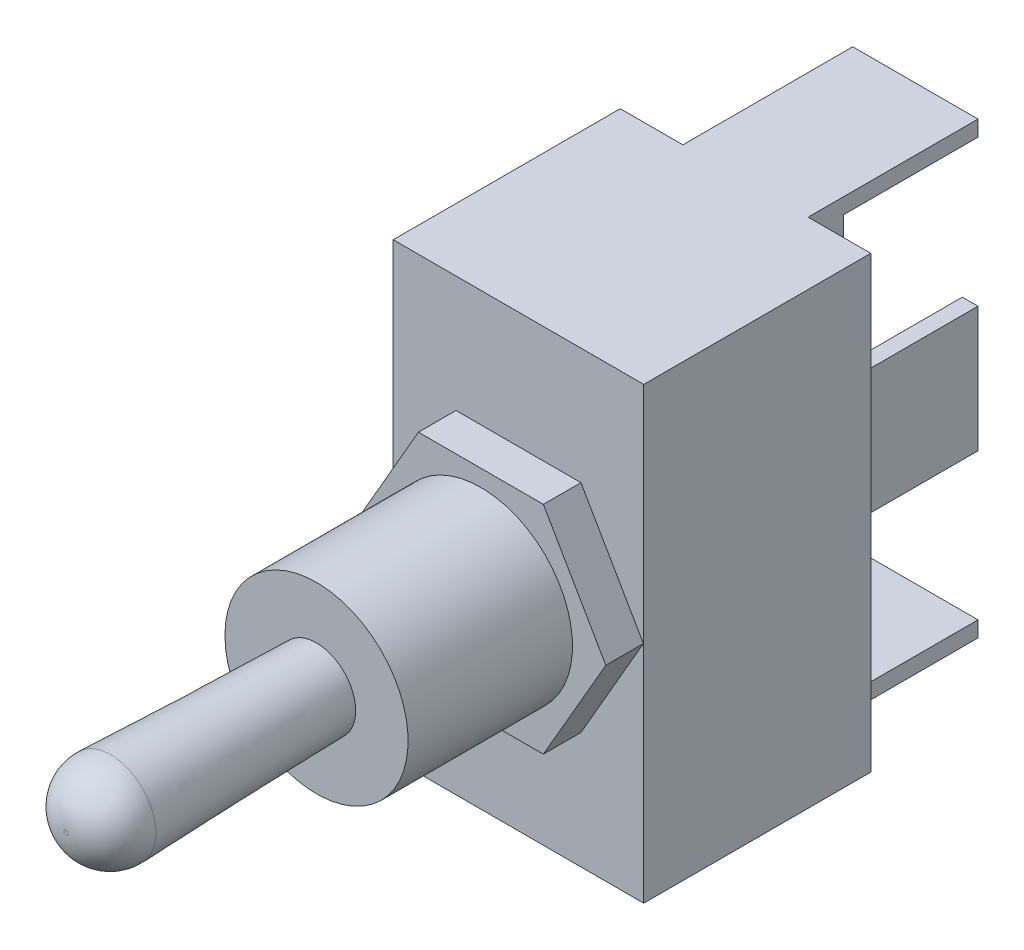
ISO-10303-21;
HEADER;
FILE_DESCRIPTION(('STEP AP214'),'2;1');
FILE_NAME('part.step','',(''),(''),'','','');
FILE_SCHEMA(('AUTOMOTIVE_DESIGN { 1 0 10303 214 1 1 1 1 }'));
ENDSEC;
DATA;
#1=APPLICATION_CONTEXT('core data for automotive mechanical design processes');
#2=APPLICATION_PROTOCOL_DEFINITION('international standard','automotive_design',2000,#1);
#3=PRODUCT_CONTEXT('',#1,'mechanical');
#4=PRODUCT('Part','Part','',(#3));
#5=PRODUCT_RELATED_PRODUCT_CATEGORY('part','',(#4));
#6=PRODUCT_DEFINITION_FORMATION('','',#4);
#7=PRODUCT_DEFINITION_CONTEXT('part definition',#1,'design');
#8=PRODUCT_DEFINITION('design','',#6,#7);
#9=PRODUCT_DEFINITION_SHAPE('','',#8);
#10=(LENGTH_UNIT() NAMED_UNIT(*) SI_UNIT(.MILLI.,.METRE.));
#11=(NAMED_UNIT(*) PLANE_ANGLE_UNIT() SI_UNIT($,.RADIAN.));
#12=(NAMED_UNIT(*) SI_UNIT($,.STERADIAN.) SOLID_ANGLE_UNIT());
#13=UNCERTAINTY_MEASURE_WITH_UNIT(LENGTH_MEASURE(1.E-05),#10,'distance_accuracy_value','');
#14=(GEOMETRIC_REPRESENTATION_CONTEXT(3) GLOBAL_UNCERTAINTY_ASSIGNED_CONTEXT((#13)) GLOBAL_UNIT_ASSIGNED_CONTEXT((#10,
#11,#12)) REPRESENTATION_CONTEXT('',''));
#15=CARTESIAN_POINT('',(0.,0.,0.));
#16=DIRECTION('',(0.,0.,1.));
#17=DIRECTION('',(1.,0.,0.));
#18=AXIS2_PLACEMENT_3D('',#15,#16,#17);
#19=CARTESIAN_POINT('',(0.,0.,-2.25));
#20=DIRECTION('',(0.,0.,1.));
#21=DIRECTION('',(1.,0.,0.));
#22=AXIS2_PLACEMENT_3D('',#19,#20,#21);
#23=PLANE('',#22);
#24=DIRECTION('',(-1.,0.,0.));
#25=VECTOR('',#24,1.);
#26=CARTESIAN_POINT('',(4.,-4.,-2.25));
#27=LINE('',#26,#25);
#28=CARTESIAN_POINT('',(4.,-4.,-2.25));
#29=VERTEX_POINT('',#28);
#30=CARTESIAN_POINT('',(3.,-4.,-2.25));
#31=VERTEX_POINT('',#30);
#32=EDGE_CURVE('E492',#29,#31,#27,.T.);
#33=ORIENTED_EDGE('',*,*,#32,.F.);
#34=DIRECTION('',(0.,-1.,0.));
#35=VECTOR('',#34,1.);
#36=CARTESIAN_POINT('',(4.,-14.35,-2.25));
#37=LINE('',#36,#35);
#38=CARTESIAN_POINT('',(4.,-13.35,-2.25));
#39=VERTEX_POINT('',#38);
#40=EDGE_CURVE('E215',#29,#39,#37,.T.);
#41=ORIENTED_EDGE('',*,*,#40,.T.);
#42=DIRECTION('',(1.,0.,0.));
#43=VECTOR('',#42,1.);
#44=CARTESIAN_POINT('',(4.,-13.35,-2.25));
#45=LINE('',#44,#43);
#46=CARTESIAN_POINT('',(-4.,-13.35,-2.25));
#47=VERTEX_POINT('',#46);
#48=EDGE_CURVE('E216',#47,#39,#45,.T.);
#49=ORIENTED_EDGE('',*,*,#48,.F.);
#50=DIRECTION('',(0.,1.,0.));
#51=VECTOR('',#50,1.);
#52=CARTESIAN_POINT('',(-4.,-14.35,-2.25));
#53=LINE('',#52,#51);
#54=CARTESIAN_POINT('',(-4.,13.35,-2.25));
#55=VERTEX_POINT('',#54);
#56=EDGE_CURVE('E263',#47,#55,#53,.T.);
#57=ORIENTED_EDGE('',*,*,#56,.T.);
#58=DIRECTION('',(-1.,0.,0.));
#59=VECTOR('',#58,1.);
#60=CARTESIAN_POINT('',(4.,13.35,-2.25));
#61=LINE('',#60,#59);
#62=CARTESIAN_POINT('',(4.,13.35,-2.25));
#63=VERTEX_POINT('',#62);
#64=EDGE_CURVE('E239',#63,#55,#61,.T.);
#65=ORIENTED_EDGE('',*,*,#64,.F.);
#66=CARTESIAN_POINT('',(4.,4.,-2.25));
#67=VERTEX_POINT('',#66);
#68=EDGE_CURVE('E266',#63,#67,#37,.T.);
#69=ORIENTED_EDGE('',*,*,#68,.T.);
#70=DIRECTION('',(1.,0.,0.));
#71=VECTOR('',#70,1.);
#72=CARTESIAN_POINT('',(4.,4.,-2.25));
#73=LINE('',#72,#71);
#74=CARTESIAN_POINT('',(3.,4.,-2.25));
#75=VERTEX_POINT('',#74);
#76=EDGE_CURVE('E64',#75,#67,#73,.T.);
#77=ORIENTED_EDGE('',*,*,#76,.F.);
#78=DIRECTION('',(0.,1.,0.));
#79=VECTOR('',#78,1.);
#80=CARTESIAN_POINT('',(3.,4.,-2.25));
#81=LINE('',#80,#79);
#82=EDGE_CURVE('E59',#31,#75,#81,.T.);
#83=ORIENTED_EDGE('',*,*,#82,.F.);
#84=EDGE_LOOP('',(#33,#41,#49,#57,#65,#69,#77,#83));
#85=FACE_BOUND('',#84,.T.);
#86=ADVANCED_FACE('F44',(#85),#23,.F.);
#87=CARTESIAN_POINT('',(0.,0.,27.4));
#88=DIRECTION('',(0.,0.,1.));
#89=DIRECTION('',(1.,0.,0.));
#90=AXIS2_PLACEMENT_3D('',#87,#88,#89);
#91=PLANE('',#90);
#92=CARTESIAN_POINT('',(0.,0.,27.4));
#93=DIRECTION('',(0.,0.,1.));
#94=DIRECTION('',(1.,0.,0.));
#95=AXIS2_PLACEMENT_3D('',#92,#93,#94);
#96=CIRCLE('',#95,5.85);
#97=CARTESIAN_POINT('',(-5.85,0.,27.4));
#98=VERTEX_POINT('',#97);
#99=EDGE_CURVE('E283',#98,#98,#96,.T.);
#100=ORIENTED_EDGE('',*,*,#99,.T.);
#101=EDGE_LOOP('',(#100));
#102=FACE_BOUND('',#101,.T.);
#103=CARTESIAN_POINT('',(0.,0.,27.4));
#104=DIRECTION('',(0.,0.,1.));
#105=DIRECTION('',(1.,0.,0.));
#106=AXIS2_PLACEMENT_3D('',#103,#104,#105);
#107=CIRCLE('',#106,2.5);
#108=CARTESIAN_POINT('',(2.46798003498705,0.398841505996216,27.4));
#109=VERTEX_POINT('',#108);
#110=EDGE_CURVE('E259',#109,#109,#107,.T.);
#111=ORIENTED_EDGE('',*,*,#110,.F.);
#112=EDGE_LOOP('',(#111));
#113=FACE_BOUND('',#112,.T.);
#114=ADVANCED_FACE('F391',(#102,#113),#91,.T.);
#115=CARTESIAN_POINT('',(0.,0.,0.));
#116=DIRECTION('',(0.,0.,-1.));
#117=DIRECTION('',(-1.,0.,0.));
#118=AXIS2_PLACEMENT_3D('',#115,#116,#117);
#119=PLANE('',#118);
#120=DIRECTION('',(0.,1.,0.));
#121=VECTOR('',#120,1.);
#122=CARTESIAN_POINT('',(-4.,-14.35,0.));
#123=LINE('',#122,#121);
#124=CARTESIAN_POINT('',(-4.,-14.35,0.));
#125=VERTEX_POINT('',#124);
#126=CARTESIAN_POINT('',(-4.,14.35,0.));
#127=VERTEX_POINT('',#126);
#128=EDGE_CURVE('E262',#125,#127,#123,.T.);
#129=ORIENTED_EDGE('',*,*,#128,.F.);
#130=DIRECTION('',(1.,0.,0.));
#131=VECTOR('',#130,1.);
#132=CARTESIAN_POINT('',(-8.,-14.35,0.));
#133=LINE('',#132,#131);
#134=CARTESIAN_POINT('',(-8.,-14.35,0.));
#135=VERTEX_POINT('',#134);
#136=EDGE_CURVE('E344',#135,#125,#133,.T.);
#137=ORIENTED_EDGE('',*,*,#136,.F.);
#138=DIRECTION('',(0.,-1.,0.));
#139=VECTOR('',#138,1.);
#140=CARTESIAN_POINT('',(-8.,-14.35,0.));
#141=LINE('',#140,#139);
#142=CARTESIAN_POINT('',(-8.,14.35,0.));
#143=VERTEX_POINT('',#142);
#144=EDGE_CURVE('E357',#143,#135,#141,.T.);
#145=ORIENTED_EDGE('',*,*,#144,.F.);
#146=DIRECTION('',(-1.,0.,0.));
#147=VECTOR('',#146,1.);
#148=CARTESIAN_POINT('',(-8.,14.35,0.));
#149=LINE('',#148,#147);
#150=EDGE_CURVE('E353',#127,#143,#149,.T.);
#151=ORIENTED_EDGE('',*,*,#150,.F.);
#152=EDGE_LOOP('',(#129,#137,#145,#151));
#153=FACE_BOUND('',#152,.T.);
#154=ADVANCED_FACE('F396',(#153),#119,.T.);
#155=CARTESIAN_POINT('',(0.,0.,14.5));
#156=DIRECTION('',(0.,0.,-1.));
#157=DIRECTION('',(-1.,0.,0.));
#158=AXIS2_PLACEMENT_3D('',#155,#156,#157);
#159=PLANE('',#158);
#160=DIRECTION('',(0.,1.,0.));
#161=VECTOR('',#160,1.);
#162=CARTESIAN_POINT('',(8.,-14.35,14.5));
#163=LINE('',#162,#161);
#164=CARTESIAN_POINT('',(8.,-14.35,14.5));
#165=VERTEX_POINT('',#164);
#166=CARTESIAN_POINT('',(8.,14.35,14.5));
#167=VERTEX_POINT('',#166);
#168=EDGE_CURVE('E340',#165,#167,#163,.T.);
#169=ORIENTED_EDGE('',*,*,#168,.T.);
#170=DIRECTION('',(-1.,0.,0.));
#171=VECTOR('',#170,1.);
#172=CARTESIAN_POINT('',(-8.,14.35,14.5));
#173=LINE('',#172,#171);
#174=CARTESIAN_POINT('',(-8.,14.35,14.5));
#175=VERTEX_POINT('',#174);
#176=EDGE_CURVE('E343',#167,#175,#173,.T.);
#177=ORIENTED_EDGE('',*,*,#176,.T.);
#178=DIRECTION('',(0.,-1.,0.));
#179=VECTOR('',#178,1.);
#180=CARTESIAN_POINT('',(-8.,-14.35,14.5));
#181=LINE('',#180,#179);
#182=CARTESIAN_POINT('',(-8.,-14.35,14.5));
#183=VERTEX_POINT('',#182);
#184=EDGE_CURVE('E346',#175,#183,#181,.T.);
#185=ORIENTED_EDGE('',*,*,#184,.T.);
#186=DIRECTION('',(1.,0.,0.));
#187=VECTOR('',#186,1.);
#188=CARTESIAN_POINT('',(-8.,-14.35,14.5));
#189=LINE('',#188,#187);
#190=EDGE_CURVE('E348',#183,#165,#189,.T.);
#191=ORIENTED_EDGE('',*,*,#190,.T.);
#192=EDGE_LOOP('',(#169,#177,#185,#191));
#193=FACE_BOUND('',#192,.T.);
#194=DIRECTION('',(-0.5,-0.866025403784439,0.));
#195=VECTOR('',#194,1.);
#196=CARTESIAN_POINT('',(-3.98949036010031,6.91,14.5));
#197=LINE('',#196,#195);
#198=CARTESIAN_POINT('',(-3.98949036010031,6.91,14.5));
#199=VERTEX_POINT('',#198);
#200=CARTESIAN_POINT('',(-7.97898072020063,0.,14.5));
#201=VERTEX_POINT('',#200);
#202=EDGE_CURVE('E286',#199,#201,#197,.T.);
#203=ORIENTED_EDGE('',*,*,#202,.F.);
#204=DIRECTION('',(-1.,0.,0.));
#205=VECTOR('',#204,1.);
#206=CARTESIAN_POINT('',(3.98949036010032,6.91,14.5));
#207=LINE('',#206,#205);
#208=CARTESIAN_POINT('',(3.98949036010032,6.91,14.5));
#209=VERTEX_POINT('',#208);
#210=EDGE_CURVE('E295',#209,#199,#207,.T.);
#211=ORIENTED_EDGE('',*,*,#210,.F.);
#212=DIRECTION('',(-0.5,0.866025403784439,0.));
#213=VECTOR('',#212,1.);
#214=CARTESIAN_POINT('',(7.97898072020063,0.,14.5));
#215=LINE('',#214,#213);
#216=CARTESIAN_POINT('',(7.97898072020063,0.,14.5));
#217=VERTEX_POINT('',#216);
#218=EDGE_CURVE('E317',#217,#209,#215,.T.);
#219=ORIENTED_EDGE('',*,*,#218,.F.);
#220=DIRECTION('',(0.5,0.866025403784439,0.));
#221=VECTOR('',#220,1.);
#222=CARTESIAN_POINT('',(3.98949036010031,-6.91,14.5));
#223=LINE('',#222,#221);
#224=CARTESIAN_POINT('',(3.98949036010031,-6.91,14.5));
#225=VERTEX_POINT('',#224);
#226=EDGE_CURVE('E314',#225,#217,#223,.T.);
#227=ORIENTED_EDGE('',*,*,#226,.F.);
#228=DIRECTION('',(1.,0.,0.));
#229=VECTOR('',#228,1.);
#230=CARTESIAN_POINT('',(-3.98949036010032,-6.91,14.5));
#231=LINE('',#230,#229);
#232=CARTESIAN_POINT('',(-3.98949036010032,-6.91,14.5));
#233=VERTEX_POINT('',#232);
#234=EDGE_CURVE('E311',#233,#225,#231,.T.);
#235=ORIENTED_EDGE('',*,*,#234,.F.);
#236=DIRECTION('',(0.5,-0.866025403784439,0.));
#237=VECTOR('',#236,1.);
#238=CARTESIAN_POINT('',(-7.97898072020063,0.,14.5));
#239=LINE('',#238,#237);
#240=EDGE_CURVE('E308',#201,#233,#239,.T.);
#241=ORIENTED_EDGE('',*,*,#240,.F.);
#242=EDGE_LOOP('',(#203,#211,#219,#227,#235,#241));
#243=FACE_BOUND('',#242,.T.);
#244=ADVANCED_FACE('F440',(#193,#243),#159,.F.);
#245=CARTESIAN_POINT('',(8.,-14.35,14.5));
#246=DIRECTION('',(-1.,0.,0.));
#247=DIRECTION('',(0.,0.,1.));
#248=AXIS2_PLACEMENT_3D('',#245,#246,#247);
#249=PLANE('',#248);
#250=DIRECTION('',(0.,1.,0.));
#251=VECTOR('',#250,1.);
#252=CARTESIAN_POINT('',(8.,-14.35,0.));
#253=LINE('',#252,#251);
#254=CARTESIAN_POINT('',(8.,-14.35,0.));
#255=VERTEX_POINT('',#254);
#256=CARTESIAN_POINT('',(8.,14.35,0.));
#257=VERTEX_POINT('',#256);
#258=EDGE_CURVE('E339',#255,#257,#253,.T.);
#259=ORIENTED_EDGE('',*,*,#258,.T.);
#260=DIRECTION('',(0.,0.,-1.));
#261=VECTOR('',#260,1.);
#262=CARTESIAN_POINT('',(8.,14.35,14.5));
#263=LINE('',#262,#261);
#264=EDGE_CURVE('E290',#167,#257,#263,.T.);
#265=ORIENTED_EDGE('',*,*,#264,.F.);
#266=ORIENTED_EDGE('',*,*,#168,.F.);
#267=DIRECTION('',(0.,0.,-1.));
#268=VECTOR('',#267,1.);
#269=CARTESIAN_POINT('',(8.,-14.35,14.5));
#270=LINE('',#269,#268);
#271=EDGE_CURVE('E350',#165,#255,#270,.T.);
#272=ORIENTED_EDGE('',*,*,#271,.T.);
#273=EDGE_LOOP('',(#259,#265,#266,#272));
#274=FACE_BOUND('',#273,.T.);
#275=ADVANCED_FACE('F443',(#274),#249,.F.);
#276=CARTESIAN_POINT('',(-8.,14.35,14.5));
#277=DIRECTION('',(0.,-1.,0.));
#278=DIRECTION('',(0.,0.,-1.));
#279=AXIS2_PLACEMENT_3D('',#276,#277,#278);
#280=PLANE('',#279);
#281=CARTESIAN_POINT('',(4.,14.35,0.));
#282=VERTEX_POINT('',#281);
#283=EDGE_CURVE('E354',#257,#282,#149,.T.);
#284=ORIENTED_EDGE('',*,*,#283,.T.);
#285=DIRECTION('',(0.,0.,1.));
#286=VECTOR('',#285,1.);
#287=CARTESIAN_POINT('',(4.,14.35,-2.25));
#288=LINE('',#287,#286);
#289=CARTESIAN_POINT('',(4.,14.35,-10.85));
#290=VERTEX_POINT('',#289);
#291=EDGE_CURVE('E277',#290,#282,#288,.T.);
#292=ORIENTED_EDGE('',*,*,#291,.F.);
#293=DIRECTION('',(1.,0.,0.));
#294=VECTOR('',#293,1.);
#295=CARTESIAN_POINT('',(4.,14.35,-10.85));
#296=LINE('',#295,#294);
#297=CARTESIAN_POINT('',(-4.,14.35,-10.85));
#298=VERTEX_POINT('',#297);
#299=EDGE_CURVE('E248',#298,#290,#296,.T.);
#300=ORIENTED_EDGE('',*,*,#299,.F.);
#301=DIRECTION('',(0.,0.,1.));
#302=VECTOR('',#301,1.);
#303=CARTESIAN_POINT('',(-4.,14.35,-2.25));
#304=LINE('',#303,#302);
#305=EDGE_CURVE('E280',#298,#127,#304,.T.);
#306=ORIENTED_EDGE('',*,*,#305,.T.);
#307=ORIENTED_EDGE('',*,*,#150,.T.);
#308=DIRECTION('',(0.,0.,-1.));
#309=VECTOR('',#308,1.);
#310=CARTESIAN_POINT('',(-8.,14.35,14.5));
#311=LINE('',#310,#309);
#312=EDGE_CURVE('E367',#175,#143,#311,.T.);
#313=ORIENTED_EDGE('',*,*,#312,.F.);
#314=ORIENTED_EDGE('',*,*,#176,.F.);
#315=ORIENTED_EDGE('',*,*,#264,.T.);
#316=EDGE_LOOP('',(#284,#292,#300,#306,#307,#313,#314,#315));
#317=FACE_BOUND('',#316,.T.);
#318=ADVANCED_FACE('F455',(#317),#280,.F.);
#319=CARTESIAN_POINT('',(-8.,-14.35,14.5));
#320=DIRECTION('',(1.,0.,0.));
#321=DIRECTION('',(0.,0.,-1.));
#322=AXIS2_PLACEMENT_3D('',#319,#320,#321);
#323=PLANE('',#322);
#324=ORIENTED_EDGE('',*,*,#144,.T.);
#325=DIRECTION('',(0.,0.,-1.));
#326=VECTOR('',#325,1.);
#327=CARTESIAN_POINT('',(-8.,-14.35,14.5));
#328=LINE('',#327,#326);
#329=EDGE_CURVE('E364',#183,#135,#328,.T.);
#330=ORIENTED_EDGE('',*,*,#329,.F.);
#331=ORIENTED_EDGE('',*,*,#184,.F.);
#332=ORIENTED_EDGE('',*,*,#312,.T.);
#333=EDGE_LOOP('',(#324,#330,#331,#332));
#334=FACE_BOUND('',#333,.T.);
#335=ADVANCED_FACE('F451',(#334),#323,.F.);
#336=CARTESIAN_POINT('',(-8.,-14.35,14.5));
#337=DIRECTION('',(0.,1.,0.));
#338=DIRECTION('',(0.,0.,1.));
#339=AXIS2_PLACEMENT_3D('',#336,#337,#338);
#340=PLANE('',#339);
#341=ORIENTED_EDGE('',*,*,#136,.T.);
#342=DIRECTION('',(0.,0.,1.));
#343=VECTOR('',#342,1.);
#344=CARTESIAN_POINT('',(-4.,-14.35,-2.25));
#345=LINE('',#344,#343);
#346=CARTESIAN_POINT('',(-4.,-14.35,-10.85));
#347=VERTEX_POINT('',#346);
#348=EDGE_CURVE('E268',#347,#125,#345,.T.);
#349=ORIENTED_EDGE('',*,*,#348,.F.);
#350=DIRECTION('',(-1.,0.,0.));
#351=VECTOR('',#350,1.);
#352=CARTESIAN_POINT('',(4.,-14.35,-10.85));
#353=LINE('',#352,#351);
#354=CARTESIAN_POINT('',(4.,-14.35,-10.85));
#355=VERTEX_POINT('',#354);
#356=EDGE_CURVE('E227',#355,#347,#353,.T.);
#357=ORIENTED_EDGE('',*,*,#356,.F.);
#358=DIRECTION('',(0.,0.,1.));
#359=VECTOR('',#358,1.);
#360=CARTESIAN_POINT('',(4.,-14.35,-2.25));
#361=LINE('',#360,#359);
#362=CARTESIAN_POINT('',(4.,-14.35,0.));
#363=VERTEX_POINT('',#362);
#364=EDGE_CURVE('E274',#355,#363,#361,.T.);
#365=ORIENTED_EDGE('',*,*,#364,.T.);
#366=EDGE_CURVE('E359',#363,#255,#133,.T.);
#367=ORIENTED_EDGE('',*,*,#366,.T.);
#368=ORIENTED_EDGE('',*,*,#271,.F.);
#369=ORIENTED_EDGE('',*,*,#190,.F.);
#370=ORIENTED_EDGE('',*,*,#329,.T.);
#371=EDGE_LOOP('',(#341,#349,#357,#365,#367,#368,#369,#370));
#372=FACE_BOUND('',#371,.T.);
#373=ADVANCED_FACE('F447',(#372),#340,.F.);
#374=DIRECTION('',(0.,-1.,0.));
#375=VECTOR('',#374,1.);
#376=CARTESIAN_POINT('',(4.,-14.35,0.));
#377=LINE('',#376,#375);
#378=EDGE_CURVE('E265',#282,#363,#377,.T.);
#379=ORIENTED_EDGE('',*,*,#378,.F.);
#380=ORIENTED_EDGE('',*,*,#283,.F.);
#381=ORIENTED_EDGE('',*,*,#258,.F.);
#382=ORIENTED_EDGE('',*,*,#366,.F.);
#383=EDGE_LOOP('',(#379,#380,#381,#382));
#384=FACE_BOUND('',#383,.T.);
#385=ADVANCED_FACE('F438',(#384),#119,.T.);
#386=CARTESIAN_POINT('',(-3.98949036010031,6.91,16.9));
#387=DIRECTION('',(0.866025403784439,-0.5,0.));
#388=DIRECTION('',(0.5,0.866025403784439,0.));
#389=AXIS2_PLACEMENT_3D('',#386,#387,#388);
#390=PLANE('',#389);
#391=ORIENTED_EDGE('',*,*,#202,.T.);
#392=DIRECTION('',(0.,0.,-1.));
#393=VECTOR('',#392,1.);
#394=CARTESIAN_POINT('',(-7.97898072020063,0.,16.9));
#395=LINE('',#394,#393);
#396=CARTESIAN_POINT('',(-7.97898072020063,0.,16.9));
#397=VERTEX_POINT('',#396);
#398=EDGE_CURVE('E336',#397,#201,#395,.T.);
#399=ORIENTED_EDGE('',*,*,#398,.F.);
#400=DIRECTION('',(-0.5,-0.866025403784439,0.));
#401=VECTOR('',#400,1.);
#402=CARTESIAN_POINT('',(-3.98949036010031,6.91,16.9));
#403=LINE('',#402,#401);
#404=CARTESIAN_POINT('',(-3.98949036010031,6.91,16.9));
#405=VERTEX_POINT('',#404);
#406=EDGE_CURVE('E291',#405,#397,#403,.T.);
#407=ORIENTED_EDGE('',*,*,#406,.F.);
#408=DIRECTION('',(0.,0.,-1.));
#409=VECTOR('',#408,1.);
#410=CARTESIAN_POINT('',(-3.98949036010031,6.91,16.9));
#411=LINE('',#410,#409);
#412=EDGE_CURVE('E305',#405,#199,#411,.T.);
#413=ORIENTED_EDGE('',*,*,#412,.T.);
#414=EDGE_LOOP('',(#391,#399,#407,#413));
#415=FACE_BOUND('',#414,.T.);
#416=ADVANCED_FACE('F434',(#415),#390,.F.);
#417=CARTESIAN_POINT('',(-7.97898072020063,0.,16.9));
#418=DIRECTION('',(0.866025403784439,0.5,0.));
#419=DIRECTION('',(-0.5,0.866025403784439,0.));
#420=AXIS2_PLACEMENT_3D('',#417,#418,#419);
#421=PLANE('',#420);
#422=ORIENTED_EDGE('',*,*,#240,.T.);
#423=DIRECTION('',(0.,0.,-1.));
#424=VECTOR('',#423,1.);
#425=CARTESIAN_POINT('',(-3.98949036010032,-6.91,16.9));
#426=LINE('',#425,#424);
#427=CARTESIAN_POINT('',(-3.98949036010032,-6.91,16.9));
#428=VERTEX_POINT('',#427);
#429=EDGE_CURVE('E333',#428,#233,#426,.T.);
#430=ORIENTED_EDGE('',*,*,#429,.F.);
#431=DIRECTION('',(0.5,-0.866025403784439,0.));
#432=VECTOR('',#431,1.);
#433=CARTESIAN_POINT('',(-7.97898072020063,0.,16.9));
#434=LINE('',#433,#432);
#435=EDGE_CURVE('E294',#397,#428,#434,.T.);
#436=ORIENTED_EDGE('',*,*,#435,.F.);
#437=ORIENTED_EDGE('',*,*,#398,.T.);
#438=EDGE_LOOP('',(#422,#430,#436,#437));
#439=FACE_BOUND('',#438,.T.);
#440=ADVANCED_FACE('F430',(#439),#421,.F.);
#441=CARTESIAN_POINT('',(-3.98949036010032,-6.91,16.9));
#442=DIRECTION('',(0.,1.,0.));
#443=DIRECTION('',(-1.,0.,0.));
#444=AXIS2_PLACEMENT_3D('',#441,#442,#443);
#445=PLANE('',#444);
#446=ORIENTED_EDGE('',*,*,#234,.T.);
#447=DIRECTION('',(0.,0.,-1.));
#448=VECTOR('',#447,1.);
#449=CARTESIAN_POINT('',(3.98949036010031,-6.91,16.9));
#450=LINE('',#449,#448);
#451=CARTESIAN_POINT('',(3.98949036010031,-6.91,16.9));
#452=VERTEX_POINT('',#451);
#453=EDGE_CURVE('E330',#452,#225,#450,.T.);
#454=ORIENTED_EDGE('',*,*,#453,.F.);
#455=DIRECTION('',(1.,0.,0.));
#456=VECTOR('',#455,1.);
#457=CARTESIAN_POINT('',(-3.98949036010032,-6.91,16.9));
#458=LINE('',#457,#456);
#459=EDGE_CURVE('E297',#428,#452,#458,.T.);
#460=ORIENTED_EDGE('',*,*,#459,.F.);
#461=ORIENTED_EDGE('',*,*,#429,.T.);
#462=EDGE_LOOP('',(#446,#454,#460,#461));
#463=FACE_BOUND('',#462,.T.);
#464=ADVANCED_FACE('F426',(#463),#445,.F.);
#465=CARTESIAN_POINT('',(3.98949036010031,-6.91,16.9));
#466=DIRECTION('',(-0.866025403784439,0.5,0.));
#467=DIRECTION('',(-0.5,-0.866025403784439,0.));
#468=AXIS2_PLACEMENT_3D('',#465,#466,#467);
#469=PLANE('',#468);
#470=ORIENTED_EDGE('',*,*,#226,.T.);
#471=DIRECTION('',(0.,0.,-1.));
#472=VECTOR('',#471,1.);
#473=CARTESIAN_POINT('',(7.97898072020063,0.,16.9));
#474=LINE('',#473,#472);
#475=CARTESIAN_POINT('',(7.97898072020063,0.,16.9));
#476=VERTEX_POINT('',#475);
#477=EDGE_CURVE('E327',#476,#217,#474,.T.);
#478=ORIENTED_EDGE('',*,*,#477,.F.);
#479=DIRECTION('',(0.5,0.866025403784439,0.));
#480=VECTOR('',#479,1.);
#481=CARTESIAN_POINT('',(3.98949036010031,-6.91,16.9));
#482=LINE('',#481,#480);
#483=EDGE_CURVE('E299',#452,#476,#482,.T.);
#484=ORIENTED_EDGE('',*,*,#483,.F.);
#485=ORIENTED_EDGE('',*,*,#453,.T.);
#486=EDGE_LOOP('',(#470,#478,#484,#485));
#487=FACE_BOUND('',#486,.T.);
#488=ADVANCED_FACE('F422',(#487),#469,.F.);
#489=CARTESIAN_POINT('',(7.97898072020063,0.,16.9));
#490=DIRECTION('',(-0.866025403784439,-0.5,0.));
#491=DIRECTION('',(0.5,-0.866025403784439,0.));
#492=AXIS2_PLACEMENT_3D('',#489,#490,#491);
#493=PLANE('',#492);
#494=ORIENTED_EDGE('',*,*,#218,.T.);
#495=DIRECTION('',(0.,0.,-1.));
#496=VECTOR('',#495,1.);
#497=CARTESIAN_POINT('',(3.98949036010032,6.91,16.9));
#498=LINE('',#497,#496);
#499=CARTESIAN_POINT('',(3.98949036010032,6.91,16.9));
#500=VERTEX_POINT('',#499);
#501=EDGE_CURVE('E324',#500,#209,#498,.T.);
#502=ORIENTED_EDGE('',*,*,#501,.F.);
#503=DIRECTION('',(-0.5,0.866025403784439,0.));
#504=VECTOR('',#503,1.);
#505=CARTESIAN_POINT('',(7.97898072020063,0.,16.9));
#506=LINE('',#505,#504);
#507=EDGE_CURVE('E301',#476,#500,#506,.T.);
#508=ORIENTED_EDGE('',*,*,#507,.F.);
#509=ORIENTED_EDGE('',*,*,#477,.T.);
#510=EDGE_LOOP('',(#494,#502,#508,#509));
#511=FACE_BOUND('',#510,.T.);
#512=ADVANCED_FACE('F418',(#511),#493,.F.);
#513=CARTESIAN_POINT('',(3.98949036010032,6.91,16.9));
#514=DIRECTION('',(0.,-1.,0.));
#515=DIRECTION('',(0.,0.,-1.));
#516=AXIS2_PLACEMENT_3D('',#513,#514,#515);
#517=PLANE('',#516);
#518=ORIENTED_EDGE('',*,*,#210,.T.);
#519=ORIENTED_EDGE('',*,*,#412,.F.);
#520=DIRECTION('',(-1.,0.,0.));
#521=VECTOR('',#520,1.);
#522=CARTESIAN_POINT('',(3.98949036010032,6.91,16.9));
#523=LINE('',#522,#521);
#524=EDGE_CURVE('E303',#500,#405,#523,.T.);
#525=ORIENTED_EDGE('',*,*,#524,.F.);
#526=ORIENTED_EDGE('',*,*,#501,.T.);
#527=EDGE_LOOP('',(#518,#519,#525,#526));
#528=FACE_BOUND('',#527,.T.);
#529=ADVANCED_FACE('F414',(#528),#517,.F.);
#530=CARTESIAN_POINT('',(0.,0.,16.9));
#531=DIRECTION('',(0.,0.,1.));
#532=DIRECTION('',(1.,0.,0.));
#533=AXIS2_PLACEMENT_3D('',#530,#531,#532);
#534=PLANE('',#533);
#535=CARTESIAN_POINT('',(0.,0.,16.9));
#536=DIRECTION('',(0.,0.,1.));
#537=DIRECTION('',(1.,0.,0.));
#538=AXIS2_PLACEMENT_3D('',#535,#536,#537);
#539=CIRCLE('',#538,5.85);
#540=CARTESIAN_POINT('',(-5.85,0.,16.9));
#541=VERTEX_POINT('',#540);
#542=EDGE_CURVE('E287',#541,#541,#539,.T.);
#543=ORIENTED_EDGE('',*,*,#542,.F.);
#544=EDGE_LOOP('',(#543));
#545=FACE_BOUND('',#544,.T.);
#546=ORIENTED_EDGE('',*,*,#406,.T.);
#547=ORIENTED_EDGE('',*,*,#435,.T.);
#548=ORIENTED_EDGE('',*,*,#459,.T.);
#549=ORIENTED_EDGE('',*,*,#483,.T.);
#550=ORIENTED_EDGE('',*,*,#507,.T.);
#551=ORIENTED_EDGE('',*,*,#524,.T.);
#552=EDGE_LOOP('',(#546,#547,#548,#549,#550,#551));
#553=FACE_BOUND('',#552,.T.);
#554=ADVANCED_FACE('F410',(#545,#553),#534,.T.);
#555=CARTESIAN_POINT('',(0.,0.,27.4));
#556=DIRECTION('',(0.,0.,-1.));
#557=DIRECTION('',(-1.,0.,0.));
#558=AXIS2_PLACEMENT_3D('',#555,#556,#557);
#559=CYLINDRICAL_SURFACE('',#558,5.85);
#560=CARTESIAN_POINT('',(-5.85,0.,27.4));
#561=CARTESIAN_POINT('',(-5.85,0.,27.290625));
#562=CARTESIAN_POINT('',(-5.85,0.,27.18125));
#563=CARTESIAN_POINT('',(-5.85,0.,26.9625));
#564=CARTESIAN_POINT('',(-5.85,0.,26.853125));
#565=CARTESIAN_POINT('',(-5.85,0.,26.634375));
#566=CARTESIAN_POINT('',(-5.85,0.,26.525));
#567=CARTESIAN_POINT('',(-5.85,0.,26.30625));
#568=CARTESIAN_POINT('',(-5.85,0.,26.196875));
#569=CARTESIAN_POINT('',(-5.85,0.,25.978125));
#570=CARTESIAN_POINT('',(-5.85,0.,25.86875));
#571=CARTESIAN_POINT('',(-5.85,0.,25.65));
#572=CARTESIAN_POINT('',(-5.85,0.,25.540625));
#573=CARTESIAN_POINT('',(-5.85,0.,25.321875));
#574=CARTESIAN_POINT('',(-5.85,0.,25.2125));
#575=CARTESIAN_POINT('',(-5.85,0.,24.99375));
#576=CARTESIAN_POINT('',(-5.85,0.,24.884375));
#577=CARTESIAN_POINT('',(-5.85,0.,24.665625));
#578=CARTESIAN_POINT('',(-5.85,0.,24.55625));
#579=CARTESIAN_POINT('',(-5.85,0.,24.3375));
#580=CARTESIAN_POINT('',(-5.85,0.,24.228125));
#581=CARTESIAN_POINT('',(-5.85,0.,24.009375));
#582=CARTESIAN_POINT('',(-5.85,0.,23.9));
#583=CARTESIAN_POINT('',(-5.85,0.,23.68125));
#584=CARTESIAN_POINT('',(-5.85,0.,23.571875));
#585=CARTESIAN_POINT('',(-5.85,0.,23.353125));
#586=CARTESIAN_POINT('',(-5.85,0.,23.24375));
#587=CARTESIAN_POINT('',(-5.85,0.,23.025));
#588=CARTESIAN_POINT('',(-5.85,0.,22.915625));
#589=CARTESIAN_POINT('',(-5.85,0.,22.696875));
#590=CARTESIAN_POINT('',(-5.85,0.,22.5875));
#591=CARTESIAN_POINT('',(-5.85,0.,22.36875));
#592=CARTESIAN_POINT('',(-5.85,0.,22.259375));
#593=CARTESIAN_POINT('',(-5.85,0.,22.040625));
#594=CARTESIAN_POINT('',(-5.85,0.,21.93125));
#595=CARTESIAN_POINT('',(-5.85,0.,21.7125));
#596=CARTESIAN_POINT('',(-5.85,0.,21.603125));
#597=CARTESIAN_POINT('',(-5.85,0.,21.384375));
#598=CARTESIAN_POINT('',(-5.85,0.,21.275));
#599=CARTESIAN_POINT('',(-5.85,0.,21.05625));
#600=CARTESIAN_POINT('',(-5.85,0.,20.946875));
#601=CARTESIAN_POINT('',(-5.85,0.,20.728125));
#602=CARTESIAN_POINT('',(-5.85,0.,20.61875));
#603=CARTESIAN_POINT('',(-5.85,0.,20.4));
#604=CARTESIAN_POINT('',(-5.85,0.,20.290625));
#605=CARTESIAN_POINT('',(-5.85,0.,20.071875));
#606=CARTESIAN_POINT('',(-5.85,0.,19.9625));
#607=CARTESIAN_POINT('',(-5.85,0.,19.74375));
#608=CARTESIAN_POINT('',(-5.85,0.,19.634375));
#609=CARTESIAN_POINT('',(-5.85,0.,19.415625));
#610=CARTESIAN_POINT('',(-5.85,0.,19.30625));
#611=CARTESIAN_POINT('',(-5.85,0.,19.0875));
#612=CARTESIAN_POINT('',(-5.85,0.,18.978125));
#613=CARTESIAN_POINT('',(-5.85,0.,18.759375));
#614=CARTESIAN_POINT('',(-5.85,0.,18.65));
#615=CARTESIAN_POINT('',(-5.85,0.,18.43125));
#616=CARTESIAN_POINT('',(-5.85,0.,18.321875));
#617=CARTESIAN_POINT('',(-5.85,0.,18.103125));
#618=CARTESIAN_POINT('',(-5.85,0.,17.99375));
#619=CARTESIAN_POINT('',(-5.85,0.,17.775));
#620=CARTESIAN_POINT('',(-5.85,0.,17.665625));
#621=CARTESIAN_POINT('',(-5.85,0.,17.446875));
#622=CARTESIAN_POINT('',(-5.85,0.,17.3375));
#623=CARTESIAN_POINT('',(-5.85,0.,17.11875));
#624=CARTESIAN_POINT('',(-5.85,0.,17.009375));
#625=CARTESIAN_POINT('',(-5.85,0.,16.9));
#626=B_SPLINE_CURVE_WITH_KNOTS('',3,(#560,#561,#562,#563,#564,#565,#566,#567,#568,#569,#570,
#571,#572,#573,#574,#575,#576,#577,#578,#579,#580,#581,#582,#583,#584,#585,#586,#587,#588,#589,
#590,#591,#592,#593,#594,#595,#596,#597,#598,#599,#600,#601,#602,#603,#604,#605,#606,#607,#608,
#609,#610,#611,#612,#613,#614,#615,#616,#617,#618,#619,#620,#621,#622,#623,#624,#625),
.UNSPECIFIED.,.F.,.F.,(4,2,2,2,2,2,2,2,2,2,2,2,2,2,2,2,2,2,2,2,2,2,2,2,2,2,2,2,2,2,2,2,4),(0.,
0.328125000000002,0.656250000000001,0.984375000000003,1.3125,1.640625,1.96875,2.296875,2.625,
2.953125,3.28125,3.609375,3.9375,4.265625,4.59375,4.921875,5.25,5.578125,5.90625,6.234375,
6.5625,6.890625,7.21875,7.546875,7.875,8.203125,8.53125,8.859375,9.1875,9.515625,9.84375,
10.171875,10.5),.UNSPECIFIED.);
#627=EDGE_CURVE('BSEAM405',#98,#541,#626,.T.);
#628=ORIENTED_EDGE('',*,*,#99,.F.);
#629=ORIENTED_EDGE('',*,*,#542,.T.);
#630=ORIENTED_EDGE('',*,*,#627,.T.);
#631=ORIENTED_EDGE('',*,*,#627,.F.);
#632=EDGE_LOOP('',(#628,#630,#629,#631));
#633=FACE_BOUND('',#632,.T.);
#634=ADVANCED_FACE('F405',(#633),#559,.T.);
#635=CARTESIAN_POINT('',(-4.,-14.35,-2.25));
#636=DIRECTION('',(1.,0.,0.));
#637=DIRECTION('',(0.,0.,-1.));
#638=AXIS2_PLACEMENT_3D('',#635,#636,#637);
#639=PLANE('',#638);
#640=ORIENTED_EDGE('',*,*,#128,.T.);
#641=ORIENTED_EDGE('',*,*,#305,.F.);
#642=DIRECTION('',(0.,1.,0.));
#643=VECTOR('',#642,1.);
#644=CARTESIAN_POINT('',(-4.,14.35,-10.85));
#645=LINE('',#644,#643);
#646=CARTESIAN_POINT('',(-4.,13.35,-10.85));
#647=VERTEX_POINT('',#646);
#648=EDGE_CURVE('E245',#647,#298,#645,.T.);
#649=ORIENTED_EDGE('',*,*,#648,.F.);
#650=DIRECTION('',(0.,0.,1.));
#651=VECTOR('',#650,1.);
#652=CARTESIAN_POINT('',(-4.,13.35,-10.85));
#653=LINE('',#652,#651);
#654=EDGE_CURVE('E251',#647,#55,#653,.T.);
#655=ORIENTED_EDGE('',*,*,#654,.T.);
#656=ORIENTED_EDGE('',*,*,#56,.F.);
#657=DIRECTION('',(0.,0.,1.));
#658=VECTOR('',#657,1.);
#659=CARTESIAN_POINT('',(-4.,-13.35,-10.85));
#660=LINE('',#659,#658);
#661=CARTESIAN_POINT('',(-4.,-13.35,-10.85));
#662=VERTEX_POINT('',#661);
#663=EDGE_CURVE('E236',#662,#47,#660,.T.);
#664=ORIENTED_EDGE('',*,*,#663,.F.);
#665=DIRECTION('',(0.,1.,0.));
#666=VECTOR('',#665,1.);
#667=CARTESIAN_POINT('',(-4.,-14.35,-10.85));
#668=LINE('',#667,#666);
#669=EDGE_CURVE('E230',#347,#662,#668,.T.);
#670=ORIENTED_EDGE('',*,*,#669,.F.);
#671=ORIENTED_EDGE('',*,*,#348,.T.);
#672=EDGE_LOOP('',(#640,#641,#649,#655,#656,#664,#670,#671));
#673=FACE_BOUND('',#672,.T.);
#674=ADVANCED_FACE('F403',(#673),#639,.F.);
#675=CARTESIAN_POINT('',(4.,-14.35,-2.25));
#676=DIRECTION('',(-1.,0.,0.));
#677=DIRECTION('',(0.,0.,1.));
#678=AXIS2_PLACEMENT_3D('',#675,#676,#677);
#679=PLANE('',#678);
#680=ORIENTED_EDGE('',*,*,#378,.T.);
#681=ORIENTED_EDGE('',*,*,#364,.F.);
#682=DIRECTION('',(0.,-1.,0.));
#683=VECTOR('',#682,1.);
#684=CARTESIAN_POINT('',(4.,-14.35,-10.85));
#685=LINE('',#684,#683);
#686=CARTESIAN_POINT('',(4.,-13.35,-10.85));
#687=VERTEX_POINT('',#686);
#688=EDGE_CURVE('E219',#687,#355,#685,.T.);
#689=ORIENTED_EDGE('',*,*,#688,.F.);
#690=DIRECTION('',(0.,0.,1.));
#691=VECTOR('',#690,1.);
#692=CARTESIAN_POINT('',(4.,-13.35,-10.85));
#693=LINE('',#692,#691);
#694=EDGE_CURVE('E233',#687,#39,#693,.T.);
#695=ORIENTED_EDGE('',*,*,#694,.T.);
#696=ORIENTED_EDGE('',*,*,#40,.F.);
#697=DIRECTION('',(0.,0.,1.));
#698=VECTOR('',#697,1.);
#699=CARTESIAN_POINT('',(4.,-4.,-10.85));
#700=LINE('',#699,#698);
#701=CARTESIAN_POINT('',(4.,-4.,-10.85));
#702=VERTEX_POINT('',#701);
#703=EDGE_CURVE('E196',#702,#29,#700,.T.);
#704=ORIENTED_EDGE('',*,*,#703,.F.);
#705=DIRECTION('',(0.,-1.,0.));
#706=VECTOR('',#705,1.);
#707=CARTESIAN_POINT('',(4.,4.,-10.85));
#708=LINE('',#707,#706);
#709=CARTESIAN_POINT('',(4.,4.,-10.85));
#710=VERTEX_POINT('',#709);
#711=EDGE_CURVE('E202',#710,#702,#708,.T.);
#712=ORIENTED_EDGE('',*,*,#711,.F.);
#713=DIRECTION('',(0.,0.,1.));
#714=VECTOR('',#713,1.);
#715=CARTESIAN_POINT('',(4.,4.,-10.85));
#716=LINE('',#715,#714);
#717=EDGE_CURVE('E499',#710,#67,#716,.T.);
#718=ORIENTED_EDGE('',*,*,#717,.T.);
#719=ORIENTED_EDGE('',*,*,#68,.F.);
#720=DIRECTION('',(0.,0.,1.));
#721=VECTOR('',#720,1.);
#722=CARTESIAN_POINT('',(4.,13.35,-10.85));
#723=LINE('',#722,#721);
#724=CARTESIAN_POINT('',(4.,13.35,-10.85));
#725=VERTEX_POINT('',#724);
#726=EDGE_CURVE('E256',#725,#63,#723,.T.);
#727=ORIENTED_EDGE('',*,*,#726,.F.);
#728=DIRECTION('',(0.,-1.,0.));
#729=VECTOR('',#728,1.);
#730=CARTESIAN_POINT('',(4.,14.35,-10.85));
#731=LINE('',#730,#729);
#732=EDGE_CURVE('E240',#290,#725,#731,.T.);
#733=ORIENTED_EDGE('',*,*,#732,.F.);
#734=ORIENTED_EDGE('',*,*,#291,.T.);
#735=EDGE_LOOP('',(#680,#681,#689,#695,#696,#704,#712,#718,#719,#727,#733,#734));
#736=FACE_BOUND('',#735,.T.);
#737=ADVANCED_FACE('F213',(#736),#679,.F.);
#738=CARTESIAN_POINT('',(0.,0.,43.4));
#739=DIRECTION('',(0.,0.,1.));
#740=DIRECTION('',(1.,0.,0.));
#741=AXIS2_PLACEMENT_3D('',#738,#739,#740);
#742=PLANE('',#741);
#743=CARTESIAN_POINT('',(0.,0.,43.4));
#744=DIRECTION('',(0.,0.,1.));
#745=DIRECTION('',(1.,0.,0.));
#746=AXIS2_PLACEMENT_3D('',#743,#744,#745);
#747=CIRCLE('',#746,0.142348045555496);
#748=CARTESIAN_POINT('',(0.142348045555496,0.,43.4));
#749=VERTEX_POINT('',#748);
#750=EDGE_CURVE('E52',#749,#749,#747,.T.);
#751=ORIENTED_EDGE('',*,*,#750,.T.);
#752=EDGE_LOOP('',(#751));
#753=FACE_BOUND('',#752,.T.);
#754=ADVANCED_FACE('F374',(#753),#742,.T.);
#755=CARTESIAN_POINT('',(2.46798003498705,0.398841505996216,27.4));
#756=CARTESIAN_POINT('',(2.95693378544699,-0.5065003341382,43.4));
#757=CARTESIAN_POINT('',(1.67029702299462,5.33480157597031,27.4));
#758=CARTESIAN_POINT('',(3.96993445372339,5.40736723675578,43.4));
#759=CARTESIAN_POINT('',(-3.26566304697948,4.53711856397788,27.4));
#760=CARTESIAN_POINT('',(-1.94393311717059,6.42036790503218,43.4));
#761=CARTESIAN_POINT('',(-2.46798003498705,-0.398841505996215,27.4));
#762=CARTESIAN_POINT('',(-2.95693378544699,0.506500334138202,43.4));
#763=CARTESIAN_POINT('',(-1.67029702299462,-5.33480157597031,27.4));
#764=CARTESIAN_POINT('',(-3.9699344537234,-5.40736723675579,43.4));
#765=CARTESIAN_POINT('',(3.26566304697948,-4.53711856397788,27.4));
#766=CARTESIAN_POINT('',(1.94393311717059,-6.42036790503219,43.4));
#767=CARTESIAN_POINT('',(2.46798003498705,0.398841505996216,27.4));
#768=CARTESIAN_POINT('',(2.95693378544699,-0.5065003341382,43.4));
#769=(BOUNDED_SURFACE() B_SPLINE_SURFACE(3,1,((#755,#756),(#757,#758),(#759,#760),(#761,#762),
(#763,#764),(#765,#766),(#767,#768)),.UNSPECIFIED.,.T.,.F.,.F.) B_SPLINE_SURFACE_WITH_KNOTS((4,
3,4),(2,2),(0.,0.5,1.),(0.,1.),
.UNSPECIFIED.) GEOMETRIC_REPRESENTATION_ITEM() RATIONAL_B_SPLINE_SURFACE(((1.,1.),
(0.333333333333333,0.333333333333334),(0.333333333333333,0.333333333333334),(1.,1.),
(0.333333333333333,0.333333333333333),(0.333333333333333,0.333333333333333),(1.,1.))) REPRESENTATION_ITEM('') SURFACE());
#770=CARTESIAN_POINT('',(0.,0.,40.5480528067096));
#771=DIRECTION('',(0.,0.,1.));
#772=DIRECTION('',(1.,0.,0.));
#773=AXIS2_PLACEMENT_3D('',#770,#771,#772);
#774=CIRCLE('',#773,2.8904577176356);
#775=CARTESIAN_POINT('',(2.86977939317993,-0.345126139141969,40.5480528067096));
#776=VERTEX_POINT('',#775);
#777=EDGE_CURVE('E12',#776,#776,#774,.F.);
#778=CARTESIAN_POINT('',(2.86977939317993,-0.345126139141969,40.5480528067096));
#779=CARTESIAN_POINT('',(2.86559398319875,-0.33737647617178,40.4110939233064));
#780=CARTESIAN_POINT('',(2.86140857321758,-0.329626813201591,40.2741350399032));
#781=CARTESIAN_POINT('',(2.85303775325523,-0.314127487261212,40.0002172730967));
#782=CARTESIAN_POINT('',(2.84885234327405,-0.306377824291022,39.8632583896935));
#783=CARTESIAN_POINT('',(2.8404815233117,-0.290878498350643,39.5893406228871));
#784=CARTESIAN_POINT('',(2.83629611333052,-0.283128835380454,39.4523817394838));
#785=CARTESIAN_POINT('',(2.82792529336817,-0.267629509440075,39.1784639726774));
#786=CARTESIAN_POINT('',(2.82373988338699,-0.259879846469886,39.0415050892741));
#787=CARTESIAN_POINT('',(2.81536906342464,-0.244380520529507,38.7675873224677));
#788=CARTESIAN_POINT('',(2.81118365344347,-0.236630857559317,38.6306284390645));
#789=CARTESIAN_POINT('',(2.80281283348112,-0.221131531618939,38.356710672258));
#790=CARTESIAN_POINT('',(2.79862742349994,-0.213381868648749,38.2197517888548));
#791=CARTESIAN_POINT('',(2.79025660353759,-0.19788254270837,37.9458340220483));
#792=CARTESIAN_POINT('',(2.78607119355641,-0.190132879738181,37.8088751386451));
#793=CARTESIAN_POINT('',(2.77770037359406,-0.174633553797802,37.5349573718387));
#794=CARTESIAN_POINT('',(2.77351496361288,-0.166883890827613,37.3979984884354));
#795=CARTESIAN_POINT('',(2.76514414365053,-0.151384564887234,37.124080721629));
#796=CARTESIAN_POINT('',(2.76095873366936,-0.143634901917044,36.9871218382258));
#797=CARTESIAN_POINT('',(2.75258791370701,-0.128135575976665,36.7132040714193));
#798=CARTESIAN_POINT('',(2.74840250372583,-0.120385913006476,36.5762451880161));
#799=CARTESIAN_POINT('',(2.74003168376348,-0.104886587066097,36.3023274212096));
#800=CARTESIAN_POINT('',(2.7358462737823,-0.0971369240959076,36.1653685378064));
#801=CARTESIAN_POINT('',(2.72747545381995,-0.0816375981555287,35.891450771));
#802=CARTESIAN_POINT('',(2.72329004383877,-0.0738879351853394,35.7544918875967));
#803=CARTESIAN_POINT('',(2.71491922387642,-0.0583886092449606,35.4805741207903));
#804=CARTESIAN_POINT('',(2.71073381389525,-0.0506389462747712,35.3436152373871));
#805=CARTESIAN_POINT('',(2.7023629939329,-0.0351396203343922,35.0696974705806));
#806=CARTESIAN_POINT('',(2.69817758395172,-0.0273899573642027,34.9327385871774));
#807=CARTESIAN_POINT('',(2.68980676398937,-0.0118906314238238,34.6588208203709));
#808=CARTESIAN_POINT('',(2.68562135400819,-0.0041409684536345,34.5218619369677));
#809=CARTESIAN_POINT('',(2.67725053404584,0.0113583574867443,34.2479441701613));
#810=CARTESIAN_POINT('',(2.67306512406466,0.0191080204569338,34.110985286758));
#811=CARTESIAN_POINT('',(2.66469430410231,0.0346073463973127,33.8370675199516));
#812=CARTESIAN_POINT('',(2.66050889412114,0.042357009367502,33.7001086365484));
#813=CARTESIAN_POINT('',(2.65213807415879,0.0578563353078809,33.4261908697419));
#814=CARTESIAN_POINT('',(2.64795266417761,0.0656059982780704,33.2892319863387));
#815=CARTESIAN_POINT('',(2.63958184421526,0.0811053242184493,33.0153142195322));
#816=CARTESIAN_POINT('',(2.63539643423408,0.0888549871886386,32.878355336129));
#817=CARTESIAN_POINT('',(2.62702561427173,0.104354313129017,32.6044375693226));
#818=CARTESIAN_POINT('',(2.62284020429055,0.112103976099207,32.4674786859193));
#819=CARTESIAN_POINT('',(2.6144693843282,0.127603302039586,32.1935609191129));
#820=CARTESIAN_POINT('',(2.61028397434703,0.135352965009775,32.0566020357097));
#821=CARTESIAN_POINT('',(2.60191315438467,0.150852290950154,31.7826842689032));
#822=CARTESIAN_POINT('',(2.5977277444035,0.158601953920344,31.6457253855));
#823=CARTESIAN_POINT('',(2.58935692444115,0.174101279860722,31.3718076186935));
#824=CARTESIAN_POINT('',(2.58517151445997,0.181850942830912,31.2348487352903));
#825=CARTESIAN_POINT('',(2.57680069449762,0.197350268771291,30.9609309684839));
#826=CARTESIAN_POINT('',(2.57261528451644,0.20509993174148,30.8239720850806));
#827=CARTESIAN_POINT('',(2.56424446455409,0.220599257681859,30.5500543182742));
#828=CARTESIAN_POINT('',(2.56005905457292,0.228348920652048,30.413095434871));
#829=CARTESIAN_POINT('',(2.55168823461056,0.243848246592427,30.1391776680645));
#830=CARTESIAN_POINT('',(2.54750282462939,0.251597909562617,30.0022187846613));
#831=CARTESIAN_POINT('',(2.53913200466704,0.267097235502996,29.7283010178548));
#832=CARTESIAN_POINT('',(2.53494659468586,0.274846898473185,29.5913421344516));
#833=CARTESIAN_POINT('',(2.52657577472351,0.290346224413564,29.3174243676452));
#834=CARTESIAN_POINT('',(2.52239036474233,0.298095887383753,29.1804654842419));
#835=CARTESIAN_POINT('',(2.51401954477998,0.313595213324132,28.9065477174355));
#836=CARTESIAN_POINT('',(2.50983413479881,0.321344876294322,28.7695888340323));
#837=CARTESIAN_POINT('',(2.50146331483645,0.3368442022347,28.4956710672258));
#838=CARTESIAN_POINT('',(2.49727790485528,0.34459386520489,28.3587121838226));
#839=CARTESIAN_POINT('',(2.48890708489293,0.360093191145269,28.0847944170161));
#840=CARTESIAN_POINT('',(2.48472167491175,0.367842854115458,27.9478355336129));
#841=CARTESIAN_POINT('',(2.4763508549494,0.383342180055837,27.6739177668065));
#842=CARTESIAN_POINT('',(2.47216544496822,0.391091843026026,27.5369588834032));
#843=CARTESIAN_POINT('',(2.46798003498705,0.398841505996216,27.4));
#844=B_SPLINE_CURVE_WITH_KNOTS('',3,(#778,#779,#780,#781,#782,#783,#784,#785,#786,#787,#788,
#789,#790,#791,#792,#793,#794,#795,#796,#797,#798,#799,#800,#801,#802,#803,#804,#805,#806,#807,
#808,#809,#810,#811,#812,#813,#814,#815,#816,#817,#818,#819,#820,#821,#822,#823,#824,#825,#826,
#827,#828,#829,#830,#831,#832,#833,#834,#835,#836,#837,#838,#839,#840,#841,#842,#843),
.UNSPECIFIED.,.F.,.F.,(4,2,2,2,2,2,2,2,2,2,2,2,2,2,2,2,2,2,2,2,2,2,2,2,2,2,2,2,2,2,2,2,4),(0.,
0.411725389165257,0.823450778330507,1.23517616749577,1.64690155666103,2.05862694582629,
2.47035233499154,2.8820777241568,3.29380311332206,3.70552850248731,4.11725389165258,
4.52897928081783,4.94070466998309,5.35243005914835,5.7641554483136,6.17588083747886,
6.58760622664412,6.99933161580938,7.41105700497463,7.82278239413989,8.23450778330515,
8.64623317247041,9.05795856163566,9.46968395080092,9.88140933996618,10.2931347291314,
10.7048601182967,11.116585507462,11.5283108966272,11.9400362857925,12.3517616749577,
12.763487064123,13.1752124532882),.UNSPECIFIED.);
#845=EDGE_CURVE('BSEAM378',#776,#109,#844,.T.);
#846=ORIENTED_EDGE('',*,*,#777,.T.);
#847=ORIENTED_EDGE('',*,*,#110,.T.);
#848=ORIENTED_EDGE('',*,*,#845,.T.);
#849=ORIENTED_EDGE('',*,*,#845,.F.);
#850=EDGE_LOOP('',(#846,#848,#847,#849));
#851=FACE_BOUND('',#850,.T.);
#852=ADVANCED_FACE('F378',(#851),#769,.T.);
#853=CARTESIAN_POINT('',(0.,0.,40.65));
#854=DIRECTION('',(0.,0.,1.));
#855=DIRECTION('',(1.,0.,0.));
#856=AXIS2_PLACEMENT_3D('',#853,#854,#855);
#857=DEGENERATE_TOROIDAL_SURFACE('',#856,0.142348045555496,2.75,.T.);
#858=ORIENTED_EDGE('',*,*,#777,.F.);
#859=EDGE_LOOP('',(#858));
#860=FACE_BOUND('',#859,.T.);
#861=ORIENTED_EDGE('',*,*,#750,.F.);
#862=EDGE_LOOP('',(#861));
#863=FACE_BOUND('',#862,.T.);
#864=ADVANCED_FACE('F46',(#860,#863),#857,.T.);
#865=CARTESIAN_POINT('',(4.,13.35,-10.85));
#866=DIRECTION('',(0.,1.,0.));
#867=DIRECTION('',(0.,0.,1.));
#868=AXIS2_PLACEMENT_3D('',#865,#866,#867);
#869=PLANE('',#868);
#870=ORIENTED_EDGE('',*,*,#64,.T.);
#871=ORIENTED_EDGE('',*,*,#654,.F.);
#872=DIRECTION('',(-1.,0.,0.));
#873=VECTOR('',#872,1.);
#874=CARTESIAN_POINT('',(4.,13.35,-10.85));
#875=LINE('',#874,#873);
#876=EDGE_CURVE('E243',#725,#647,#875,.T.);
#877=ORIENTED_EDGE('',*,*,#876,.F.);
#878=ORIENTED_EDGE('',*,*,#726,.T.);
#879=EDGE_LOOP('',(#870,#871,#877,#878));
#880=FACE_BOUND('',#879,.T.);
#881=ADVANCED_FACE('F377',(#880),#869,.F.);
#882=CARTESIAN_POINT('',(0.,0.,-10.85));
#883=DIRECTION('',(0.,0.,-1.));
#884=DIRECTION('',(-1.,0.,0.));
#885=AXIS2_PLACEMENT_3D('',#882,#883,#884);
#886=PLANE('',#885);
#887=ORIENTED_EDGE('',*,*,#732,.T.);
#888=ORIENTED_EDGE('',*,*,#876,.T.);
#889=ORIENTED_EDGE('',*,*,#648,.T.);
#890=ORIENTED_EDGE('',*,*,#299,.T.);
#891=EDGE_LOOP('',(#887,#888,#889,#890));
#892=FACE_BOUND('',#891,.T.);
#893=ADVANCED_FACE('F384',(#892),#886,.T.);
#894=CARTESIAN_POINT('',(4.,-13.35,-10.85));
#895=DIRECTION('',(0.,-1.,0.));
#896=DIRECTION('',(0.,0.,-1.));
#897=AXIS2_PLACEMENT_3D('',#894,#895,#896);
#898=PLANE('',#897);
#899=ORIENTED_EDGE('',*,*,#48,.T.);
#900=ORIENTED_EDGE('',*,*,#694,.F.);
#901=DIRECTION('',(1.,0.,0.));
#902=VECTOR('',#901,1.);
#903=CARTESIAN_POINT('',(4.,-13.35,-10.85));
#904=LINE('',#903,#902);
#905=EDGE_CURVE('E232',#662,#687,#904,.T.);
#906=ORIENTED_EDGE('',*,*,#905,.F.);
#907=ORIENTED_EDGE('',*,*,#663,.T.);
#908=EDGE_LOOP('',(#899,#900,#906,#907));
#909=FACE_BOUND('',#908,.T.);
#910=ADVANCED_FACE('F491',(#909),#898,.F.);
#911=CARTESIAN_POINT('',(0.,0.,-10.85));
#912=DIRECTION('',(0.,0.,1.));
#913=DIRECTION('',(1.,0.,0.));
#914=AXIS2_PLACEMENT_3D('',#911,#912,#913);
#915=PLANE('',#914);
#916=ORIENTED_EDGE('',*,*,#688,.T.);
#917=ORIENTED_EDGE('',*,*,#356,.T.);
#918=ORIENTED_EDGE('',*,*,#669,.T.);
#919=ORIENTED_EDGE('',*,*,#905,.T.);
#920=EDGE_LOOP('',(#916,#917,#918,#919));
#921=FACE_BOUND('',#920,.T.);
#922=ADVANCED_FACE('F488',(#921),#915,.F.);
#923=CARTESIAN_POINT('',(4.,-4.,-10.85));
#924=DIRECTION('',(0.,1.,0.));
#925=DIRECTION('',(0.,0.,1.));
#926=AXIS2_PLACEMENT_3D('',#923,#924,#925);
#927=PLANE('',#926);
#928=ORIENTED_EDGE('',*,*,#32,.T.);
#929=DIRECTION('',(0.,0.,1.));
#930=VECTOR('',#929,1.);
#931=CARTESIAN_POINT('',(3.,-4.,-10.85));
#932=LINE('',#931,#930);
#933=CARTESIAN_POINT('',(3.,-4.,-10.85));
#934=VERTEX_POINT('',#933);
#935=EDGE_CURVE('E198',#934,#31,#932,.T.);
#936=ORIENTED_EDGE('',*,*,#935,.F.);
#937=DIRECTION('',(-1.,0.,0.));
#938=VECTOR('',#937,1.);
#939=CARTESIAN_POINT('',(4.,-4.,-10.85));
#940=LINE('',#939,#938);
#941=EDGE_CURVE('E192',#702,#934,#940,.T.);
#942=ORIENTED_EDGE('',*,*,#941,.F.);
#943=ORIENTED_EDGE('',*,*,#703,.T.);
#944=EDGE_LOOP('',(#928,#936,#942,#943));
#945=FACE_BOUND('',#944,.T.);
#946=ADVANCED_FACE('F194',(#945),#927,.F.);
#947=CARTESIAN_POINT('',(3.,4.,-10.85));
#948=DIRECTION('',(1.,0.,0.));
#949=DIRECTION('',(0.,0.,-1.));
#950=AXIS2_PLACEMENT_3D('',#947,#948,#949);
#951=PLANE('',#950);
#952=ORIENTED_EDGE('',*,*,#82,.T.);
#953=DIRECTION('',(0.,0.,1.));
#954=VECTOR('',#953,1.);
#955=CARTESIAN_POINT('',(3.,4.,-10.85));
#956=LINE('',#955,#954);
#957=CARTESIAN_POINT('',(3.,4.,-10.85));
#958=VERTEX_POINT('',#957);
#959=EDGE_CURVE('E221',#958,#75,#956,.T.);
#960=ORIENTED_EDGE('',*,*,#959,.F.);
#961=DIRECTION('',(0.,1.,0.));
#962=VECTOR('',#961,1.);
#963=CARTESIAN_POINT('',(3.,4.,-10.85));
#964=LINE('',#963,#962);
#965=EDGE_CURVE('E201',#934,#958,#964,.T.);
#966=ORIENTED_EDGE('',*,*,#965,.F.);
#967=ORIENTED_EDGE('',*,*,#935,.T.);
#968=EDGE_LOOP('',(#952,#960,#966,#967));
#969=FACE_BOUND('',#968,.T.);
#970=ADVANCED_FACE('F505',(#969),#951,.F.);
#971=CARTESIAN_POINT('',(4.,4.,-10.85));
#972=DIRECTION('',(0.,-1.,0.));
#973=DIRECTION('',(0.,0.,-1.));
#974=AXIS2_PLACEMENT_3D('',#971,#972,#973);
#975=PLANE('',#974);
#976=ORIENTED_EDGE('',*,*,#76,.T.);
#977=ORIENTED_EDGE('',*,*,#717,.F.);
#978=DIRECTION('',(1.,0.,0.));
#979=VECTOR('',#978,1.);
#980=CARTESIAN_POINT('',(4.,4.,-10.85));
#981=LINE('',#980,#979);
#982=EDGE_CURVE('E207',#958,#710,#981,.T.);
#983=ORIENTED_EDGE('',*,*,#982,.F.);
#984=ORIENTED_EDGE('',*,*,#959,.T.);
#985=EDGE_LOOP('',(#976,#977,#983,#984));
#986=FACE_BOUND('',#985,.T.);
#987=ADVANCED_FACE('F503',(#986),#975,.F.);
#988=CARTESIAN_POINT('',(0.,0.,-10.85));
#989=DIRECTION('',(0.,0.,-1.));
#990=DIRECTION('',(-1.,0.,0.));
#991=AXIS2_PLACEMENT_3D('',#988,#989,#990);
#992=PLANE('',#991);
#993=ORIENTED_EDGE('',*,*,#711,.T.);
#994=ORIENTED_EDGE('',*,*,#941,.T.);
#995=ORIENTED_EDGE('',*,*,#965,.T.);
#996=ORIENTED_EDGE('',*,*,#982,.T.);
#997=EDGE_LOOP('',(#993,#994,#995,#996));
#998=FACE_BOUND('',#997,.T.);
#999=ADVANCED_FACE('F205',(#998),#992,.T.);
#1000=CLOSED_SHELL('',(#86,#114,#154,#244,#275,#318,#335,#373,#385,#416,#440,#464,#488,#512,
#529,#554,#634,#674,#737,#754,#852,#864,#881,#893,#910,#922,#946,#970,#987,#999));
#1001=MANIFOLD_SOLID_BREP('B2',#1000);
#1002=ADVANCED_BREP_SHAPE_REPRESENTATION('',(#18,#1001),#14);
#1003=SHAPE_DEFINITION_REPRESENTATION(#9,#1002);
ENDSEC;
END-ISO-10303-21;
